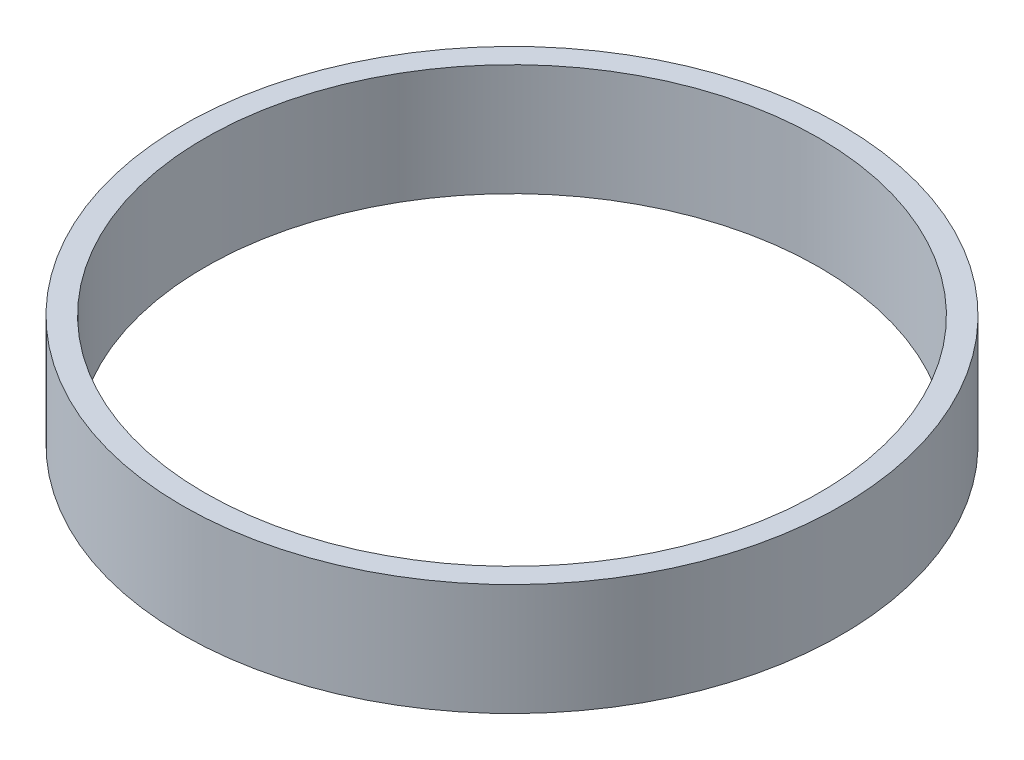
ISO-10303-21;
HEADER;
FILE_DESCRIPTION(('STEP AP214'),'2;1');
FILE_NAME('part.step','',(''),(''),'','','');
FILE_SCHEMA(('AUTOMOTIVE_DESIGN { 1 0 10303 214 1 1 1 1 }'));
ENDSEC;
DATA;
#1=APPLICATION_CONTEXT('core data for automotive mechanical design processes');
#2=APPLICATION_PROTOCOL_DEFINITION('international standard','automotive_design',2000,#1);
#3=PRODUCT_CONTEXT('',#1,'mechanical');
#4=PRODUCT('Part','Part','',(#3));
#5=PRODUCT_RELATED_PRODUCT_CATEGORY('part','',(#4));
#6=PRODUCT_DEFINITION_FORMATION('','',#4);
#7=PRODUCT_DEFINITION_CONTEXT('part definition',#1,'design');
#8=PRODUCT_DEFINITION('design','',#6,#7);
#9=PRODUCT_DEFINITION_SHAPE('','',#8);
#10=(LENGTH_UNIT() NAMED_UNIT(*) SI_UNIT(.MILLI.,.METRE.));
#11=(NAMED_UNIT(*) PLANE_ANGLE_UNIT() SI_UNIT($,.RADIAN.));
#12=(NAMED_UNIT(*) SI_UNIT($,.STERADIAN.) SOLID_ANGLE_UNIT());
#13=UNCERTAINTY_MEASURE_WITH_UNIT(LENGTH_MEASURE(1.E-05),#10,'distance_accuracy_value','');
#14=(GEOMETRIC_REPRESENTATION_CONTEXT(3) GLOBAL_UNCERTAINTY_ASSIGNED_CONTEXT((#13)) GLOBAL_UNIT_ASSIGNED_CONTEXT((#10,
#11,#12)) REPRESENTATION_CONTEXT('',''));
#15=CARTESIAN_POINT('',(0.,0.,0.));
#16=DIRECTION('',(0.,0.,1.));
#17=DIRECTION('',(1.,0.,0.));
#18=AXIS2_PLACEMENT_3D('',#15,#16,#17);
#19=CARTESIAN_POINT('',(0.,10.,0.));
#20=DIRECTION('',(0.,1.,0.));
#21=DIRECTION('',(0.,0.,1.));
#22=AXIS2_PLACEMENT_3D('',#19,#20,#21);
#23=PLANE('',#22);
#24=CARTESIAN_POINT('',(0.,10.,0.));
#25=DIRECTION('',(0.,1.,0.));
#26=DIRECTION('',(0.,0.,1.));
#27=AXIS2_PLACEMENT_3D('',#24,#25,#26);
#28=CIRCLE('',#27,29.5);
#29=CARTESIAN_POINT('',(0.,10.,29.5));
#30=VERTEX_POINT('',#29);
#31=EDGE_CURVE('E10',#30,#30,#28,.T.);
#32=ORIENTED_EDGE('',*,*,#31,.T.);
#33=EDGE_LOOP('',(#32));
#34=FACE_BOUND('',#33,.T.);
#35=CARTESIAN_POINT('',(0.,10.,0.));
#36=DIRECTION('',(0.,1.,0.));
#37=DIRECTION('',(0.,0.,1.));
#38=AXIS2_PLACEMENT_3D('',#35,#36,#37);
#39=CIRCLE('',#38,27.5);
#40=CARTESIAN_POINT('',(0.,10.,27.5));
#41=VERTEX_POINT('',#40);
#42=EDGE_CURVE('E41',#41,#41,#39,.T.);
#43=ORIENTED_EDGE('',*,*,#42,.F.);
#44=EDGE_LOOP('',(#43));
#45=FACE_BOUND('',#44,.T.);
#46=ADVANCED_FACE('F30',(#34,#45),#23,.T.);
#47=CARTESIAN_POINT('',(0.,0.,0.));
#48=DIRECTION('',(0.,1.,0.));
#49=DIRECTION('',(0.,0.,1.));
#50=AXIS2_PLACEMENT_3D('',#47,#48,#49);
#51=PLANE('',#50);
#52=CARTESIAN_POINT('',(0.,0.,0.));
#53=DIRECTION('',(0.,1.,0.));
#54=DIRECTION('',(0.,0.,1.));
#55=AXIS2_PLACEMENT_3D('',#52,#53,#54);
#56=CIRCLE('',#55,29.5);
#57=CARTESIAN_POINT('',(0.,0.,29.5));
#58=VERTEX_POINT('',#57);
#59=EDGE_CURVE('E34',#58,#58,#56,.T.);
#60=ORIENTED_EDGE('',*,*,#59,.F.);
#61=EDGE_LOOP('',(#60));
#62=FACE_BOUND('',#61,.T.);
#63=CARTESIAN_POINT('',(0.,0.,0.));
#64=DIRECTION('',(0.,1.,0.));
#65=DIRECTION('',(0.,0.,1.));
#66=AXIS2_PLACEMENT_3D('',#63,#64,#65);
#67=CIRCLE('',#66,27.5);
#68=CARTESIAN_POINT('',(0.,0.,27.5));
#69=VERTEX_POINT('',#68);
#70=EDGE_CURVE('E43',#69,#69,#67,.T.);
#71=ORIENTED_EDGE('',*,*,#70,.T.);
#72=EDGE_LOOP('',(#71));
#73=FACE_BOUND('',#72,.T.);
#74=ADVANCED_FACE('F53',(#62,#73),#51,.F.);
#75=CARTESIAN_POINT('',(0.,10.,0.));
#76=DIRECTION('',(0.,-1.,0.));
#77=DIRECTION('',(0.,0.,-1.));
#78=AXIS2_PLACEMENT_3D('',#75,#76,#77);
#79=CYLINDRICAL_SURFACE('',#78,29.5);
#80=ORIENTED_EDGE('',*,*,#31,.F.);
#81=EDGE_LOOP('',(#80));
#82=FACE_BOUND('',#81,.T.);
#83=ORIENTED_EDGE('',*,*,#59,.T.);
#84=EDGE_LOOP('',(#83));
#85=FACE_BOUND('',#84,.T.);
#86=ADVANCED_FACE('F32',(#82,#85),#79,.T.);
#87=CARTESIAN_POINT('',(0.,10.,0.));
#88=DIRECTION('',(0.,-1.,0.));
#89=DIRECTION('',(0.,0.,-1.));
#90=AXIS2_PLACEMENT_3D('',#87,#88,#89);
#91=CYLINDRICAL_SURFACE('',#90,27.5);
#92=ORIENTED_EDGE('',*,*,#42,.T.);
#93=EDGE_LOOP('',(#92));
#94=FACE_BOUND('',#93,.T.);
#95=ORIENTED_EDGE('',*,*,#70,.F.);
#96=EDGE_LOOP('',(#95));
#97=FACE_BOUND('',#96,.T.);
#98=ADVANCED_FACE('F49',(#94,#97),#91,.F.);
#99=CLOSED_SHELL('',(#46,#74,#86,#98));
#100=MANIFOLD_SOLID_BREP('B2',#99);
#101=ADVANCED_BREP_SHAPE_REPRESENTATION('',(#18,#100),#14);
#102=SHAPE_DEFINITION_REPRESENTATION(#9,#101);
ENDSEC;
END-ISO-10303-21;
